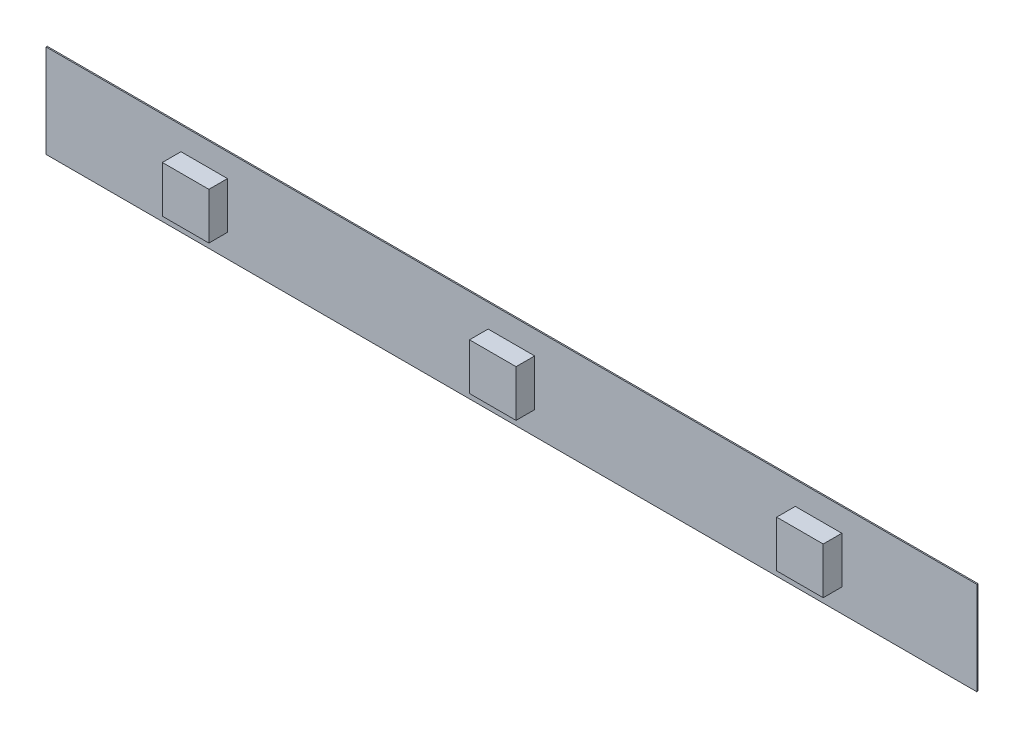
ISO-10303-21;
HEADER;
FILE_DESCRIPTION(('STEP AP214'),'2;1');
FILE_NAME('part.step','',(''),(''),'','','');
FILE_SCHEMA(('AUTOMOTIVE_DESIGN { 1 0 10303 214 1 1 1 1 }'));
ENDSEC;
DATA;
#1=APPLICATION_CONTEXT('core data for automotive mechanical design processes');
#2=APPLICATION_PROTOCOL_DEFINITION('international standard','automotive_design',2000,#1);
#3=PRODUCT_CONTEXT('',#1,'mechanical');
#4=PRODUCT('Part','Part','',(#3));
#5=PRODUCT_RELATED_PRODUCT_CATEGORY('part','',(#4));
#6=PRODUCT_DEFINITION_FORMATION('','',#4);
#7=PRODUCT_DEFINITION_CONTEXT('part definition',#1,'design');
#8=PRODUCT_DEFINITION('design','',#6,#7);
#9=PRODUCT_DEFINITION_SHAPE('','',#8);
#10=(LENGTH_UNIT() NAMED_UNIT(*) SI_UNIT(.MILLI.,.METRE.));
#11=(NAMED_UNIT(*) PLANE_ANGLE_UNIT() SI_UNIT($,.RADIAN.));
#12=(NAMED_UNIT(*) SI_UNIT($,.STERADIAN.) SOLID_ANGLE_UNIT());
#13=UNCERTAINTY_MEASURE_WITH_UNIT(LENGTH_MEASURE(1.E-05),#10,'distance_accuracy_value','');
#14=(GEOMETRIC_REPRESENTATION_CONTEXT(3) GLOBAL_UNCERTAINTY_ASSIGNED_CONTEXT((#13)) GLOBAL_UNIT_ASSIGNED_CONTEXT((#10,
#11,#12)) REPRESENTATION_CONTEXT('',''));
#15=CARTESIAN_POINT('',(0.,0.,0.));
#16=DIRECTION('',(0.,0.,1.));
#17=DIRECTION('',(1.,0.,0.));
#18=AXIS2_PLACEMENT_3D('',#15,#16,#17);
#19=CARTESIAN_POINT('',(0.,0.,0.13));
#20=DIRECTION('',(0.,0.,1.));
#21=DIRECTION('',(1.,0.,0.));
#22=AXIS2_PLACEMENT_3D('',#19,#20,#21);
#23=PLANE('',#22);
#24=DIRECTION('',(0.,-1.,0.));
#25=VECTOR('',#24,1.);
#26=CARTESIAN_POINT('',(-54.4155040130895,5.80985915492958,0.13));
#27=LINE('',#26,#25);
#28=CARTESIAN_POINT('',(-54.4155040130895,5.80985915492958,0.13));
#29=VERTEX_POINT('',#28);
#30=CARTESIAN_POINT('',(-54.4155040130895,-4.19014084507042,0.13));
#31=VERTEX_POINT('',#30);
#32=EDGE_CURVE('E234',#29,#31,#27,.T.);
#33=ORIENTED_EDGE('',*,*,#32,.T.);
#34=DIRECTION('',(1.,0.,0.));
#35=VECTOR('',#34,1.);
#36=CARTESIAN_POINT('',(-54.4155040130895,-4.19014084507042,0.13));
#37=LINE('',#36,#35);
#38=CARTESIAN_POINT('',(45.5844959869105,-4.19014084507042,0.13));
#39=VERTEX_POINT('',#38);
#40=EDGE_CURVE('E237',#31,#39,#37,.T.);
#41=ORIENTED_EDGE('',*,*,#40,.T.);
#42=DIRECTION('',(0.,1.,0.));
#43=VECTOR('',#42,1.);
#44=CARTESIAN_POINT('',(45.5844959869105,5.80985915492958,0.13));
#45=LINE('',#44,#43);
#46=CARTESIAN_POINT('',(45.5844959869105,5.80985915492958,0.13));
#47=VERTEX_POINT('',#46);
#48=EDGE_CURVE('E240',#39,#47,#45,.T.);
#49=ORIENTED_EDGE('',*,*,#48,.T.);
#50=DIRECTION('',(-1.,0.,0.));
#51=VECTOR('',#50,1.);
#52=CARTESIAN_POINT('',(-54.4155040130895,5.80985915492958,0.13));
#53=LINE('',#52,#51);
#54=EDGE_CURVE('E242',#47,#29,#53,.T.);
#55=ORIENTED_EDGE('',*,*,#54,.T.);
#56=EDGE_LOOP('',(#33,#41,#49,#55));
#57=FACE_BOUND('',#56,.T.);
#58=DIRECTION('',(1.,0.,0.));
#59=VECTOR('',#58,1.);
#60=CARTESIAN_POINT('',(-39.9155040130895,-1.69014084507042,0.13));
#61=LINE('',#60,#59);
#62=CARTESIAN_POINT('',(-39.9155040130895,-1.69014084507042,0.13));
#63=VERTEX_POINT('',#62);
#64=CARTESIAN_POINT('',(-34.9155040130895,-1.69014084507042,0.13));
#65=VERTEX_POINT('',#64);
#66=EDGE_CURVE('E218',#63,#65,#61,.T.);
#67=ORIENTED_EDGE('',*,*,#66,.F.);
#68=DIRECTION('',(0.,-1.,0.));
#69=VECTOR('',#68,1.);
#70=CARTESIAN_POINT('',(-39.9155040130895,3.30985915492958,0.13));
#71=LINE('',#70,#69);
#72=CARTESIAN_POINT('',(-39.9155040130895,3.30985915492958,0.13));
#73=VERTEX_POINT('',#72);
#74=EDGE_CURVE('E204',#73,#63,#71,.T.);
#75=ORIENTED_EDGE('',*,*,#74,.F.);
#76=DIRECTION('',(-1.,0.,0.));
#77=VECTOR('',#76,1.);
#78=CARTESIAN_POINT('',(-39.9155040130895,3.30985915492958,0.13));
#79=LINE('',#78,#77);
#80=CARTESIAN_POINT('',(-34.9155040130895,3.30985915492958,0.13));
#81=VERTEX_POINT('',#80);
#82=EDGE_CURVE('E209',#81,#73,#79,.T.);
#83=ORIENTED_EDGE('',*,*,#82,.F.);
#84=DIRECTION('',(0.,1.,0.));
#85=VECTOR('',#84,1.);
#86=CARTESIAN_POINT('',(-34.9155040130895,3.30985915492958,0.13));
#87=LINE('',#86,#85);
#88=EDGE_CURVE('E220',#65,#81,#87,.T.);
#89=ORIENTED_EDGE('',*,*,#88,.F.);
#90=EDGE_LOOP('',(#67,#75,#83,#89));
#91=FACE_BOUND('',#90,.T.);
#92=DIRECTION('',(1.,0.,0.));
#93=VECTOR('',#92,1.);
#94=CARTESIAN_POINT('',(-6.91550401308951,-1.69014084507042,0.13));
#95=LINE('',#94,#93);
#96=CARTESIAN_POINT('',(-6.91550401308951,-1.69014084507042,0.13));
#97=VERTEX_POINT('',#96);
#98=CARTESIAN_POINT('',(-1.91550401308951,-1.69014084507042,0.13));
#99=VERTEX_POINT('',#98);
#100=EDGE_CURVE('E176',#97,#99,#95,.T.);
#101=ORIENTED_EDGE('',*,*,#100,.F.);
#102=DIRECTION('',(0.,-1.,0.));
#103=VECTOR('',#102,1.);
#104=CARTESIAN_POINT('',(-6.91550401308951,3.30985915492958,0.13));
#105=LINE('',#104,#103);
#106=CARTESIAN_POINT('',(-6.91550401308951,3.30985915492958,0.13));
#107=VERTEX_POINT('',#106);
#108=EDGE_CURVE('E173',#107,#97,#105,.T.);
#109=ORIENTED_EDGE('',*,*,#108,.F.);
#110=DIRECTION('',(-1.,0.,0.));
#111=VECTOR('',#110,1.);
#112=CARTESIAN_POINT('',(-6.91550401308951,3.30985915492958,0.13));
#113=LINE('',#112,#111);
#114=CARTESIAN_POINT('',(-1.91550401308951,3.30985915492958,0.13));
#115=VERTEX_POINT('',#114);
#116=EDGE_CURVE('E185',#115,#107,#113,.T.);
#117=ORIENTED_EDGE('',*,*,#116,.F.);
#118=DIRECTION('',(0.,1.,0.));
#119=VECTOR('',#118,1.);
#120=CARTESIAN_POINT('',(-1.91550401308951,3.30985915492958,0.13));
#121=LINE('',#120,#119);
#122=EDGE_CURVE('E193',#99,#115,#121,.T.);
#123=ORIENTED_EDGE('',*,*,#122,.F.);
#124=EDGE_LOOP('',(#101,#109,#117,#123));
#125=FACE_BOUND('',#124,.T.);
#126=DIRECTION('',(1.,0.,0.));
#127=VECTOR('',#126,1.);
#128=CARTESIAN_POINT('',(26.0844959869105,-1.69014084507042,0.13));
#129=LINE('',#128,#127);
#130=CARTESIAN_POINT('',(26.0844959869105,-1.69014084507042,0.13));
#131=VERTEX_POINT('',#130);
#132=CARTESIAN_POINT('',(31.0844959869105,-1.69014084507042,0.13));
#133=VERTEX_POINT('',#132);
#134=EDGE_CURVE('E507',#131,#133,#129,.T.);
#135=ORIENTED_EDGE('',*,*,#134,.F.);
#136=DIRECTION('',(0.,-1.,0.));
#137=VECTOR('',#136,1.);
#138=CARTESIAN_POINT('',(26.0844959869105,3.30985915492958,0.13));
#139=LINE('',#138,#137);
#140=CARTESIAN_POINT('',(26.0844959869105,3.30985915492958,0.13));
#141=VERTEX_POINT('',#140);
#142=EDGE_CURVE('E171',#141,#131,#139,.T.);
#143=ORIENTED_EDGE('',*,*,#142,.F.);
#144=DIRECTION('',(-1.,0.,0.));
#145=VECTOR('',#144,1.);
#146=CARTESIAN_POINT('',(26.0844959869105,3.30985915492958,0.13));
#147=LINE('',#146,#145);
#148=CARTESIAN_POINT('',(31.0844959869103,3.30985915492958,0.13));
#149=VERTEX_POINT('',#148);
#150=EDGE_CURVE('E167',#149,#141,#147,.T.);
#151=ORIENTED_EDGE('',*,*,#150,.F.);
#152=DIRECTION('',(0.,1.,0.));
#153=VECTOR('',#152,1.);
#154=CARTESIAN_POINT('',(31.0844959869103,3.30985915492958,0.13));
#155=LINE('',#154,#153);
#156=EDGE_CURVE('E504',#133,#149,#155,.T.);
#157=ORIENTED_EDGE('',*,*,#156,.F.);
#158=EDGE_LOOP('',(#135,#143,#151,#157));
#159=FACE_BOUND('',#158,.T.);
#160=ADVANCED_FACE('F34',(#57,#91,#125,#159),#23,.T.);
#161=CARTESIAN_POINT('',(-54.4155040130895,5.80985915492958,0.13));
#162=DIRECTION('',(1.,0.,0.));
#163=DIRECTION('',(0.,1.,0.));
#164=AXIS2_PLACEMENT_3D('',#161,#162,#163);
#165=PLANE('',#164);
#166=DIRECTION('',(0.,-1.,0.));
#167=VECTOR('',#166,1.);
#168=CARTESIAN_POINT('',(-54.4155040130895,5.80985915492958,0.));
#169=LINE('',#168,#167);
#170=CARTESIAN_POINT('',(-54.4155040130895,5.80985915492958,0.));
#171=VERTEX_POINT('',#170);
#172=CARTESIAN_POINT('',(-54.4155040130895,-4.19014084507042,0.));
#173=VERTEX_POINT('',#172);
#174=EDGE_CURVE('E233',#171,#173,#169,.T.);
#175=ORIENTED_EDGE('',*,*,#174,.T.);
#176=DIRECTION('',(0.,0.,-1.));
#177=VECTOR('',#176,1.);
#178=CARTESIAN_POINT('',(-54.4155040130895,-4.19014084507042,0.13));
#179=LINE('',#178,#177);
#180=EDGE_CURVE('E11',#31,#173,#179,.T.);
#181=ORIENTED_EDGE('',*,*,#180,.F.);
#182=ORIENTED_EDGE('',*,*,#32,.F.);
#183=DIRECTION('',(0.,0.,-1.));
#184=VECTOR('',#183,1.);
#185=CARTESIAN_POINT('',(-54.4155040130895,5.80985915492958,0.13));
#186=LINE('',#185,#184);
#187=EDGE_CURVE('E244',#29,#171,#186,.T.);
#188=ORIENTED_EDGE('',*,*,#187,.T.);
#189=EDGE_LOOP('',(#175,#181,#182,#188));
#190=FACE_BOUND('',#189,.T.);
#191=ADVANCED_FACE('F36',(#190),#165,.F.);
#192=CARTESIAN_POINT('',(-54.4155040130895,-4.19014084507042,0.13));
#193=DIRECTION('',(0.,1.,0.));
#194=DIRECTION('',(0.,0.,1.));
#195=AXIS2_PLACEMENT_3D('',#192,#193,#194);
#196=PLANE('',#195);
#197=DIRECTION('',(1.,0.,0.));
#198=VECTOR('',#197,1.);
#199=CARTESIAN_POINT('',(-54.4155040130895,-4.19014084507042,0.));
#200=LINE('',#199,#198);
#201=CARTESIAN_POINT('',(45.5844959869105,-4.19014084507042,0.));
#202=VERTEX_POINT('',#201);
#203=EDGE_CURVE('E247',#173,#202,#200,.T.);
#204=ORIENTED_EDGE('',*,*,#203,.T.);
#205=DIRECTION('',(0.,0.,-1.));
#206=VECTOR('',#205,1.);
#207=CARTESIAN_POINT('',(45.5844959869105,-4.19014084507042,0.13));
#208=LINE('',#207,#206);
#209=EDGE_CURVE('E42',#39,#202,#208,.T.);
#210=ORIENTED_EDGE('',*,*,#209,.F.);
#211=ORIENTED_EDGE('',*,*,#40,.F.);
#212=ORIENTED_EDGE('',*,*,#180,.T.);
#213=EDGE_LOOP('',(#204,#210,#211,#212));
#214=FACE_BOUND('',#213,.T.);
#215=ADVANCED_FACE('F277',(#214),#196,.F.);
#216=CARTESIAN_POINT('',(45.5844959869105,5.80985915492958,0.13));
#217=DIRECTION('',(-1.,0.,0.));
#218=DIRECTION('',(0.,0.,1.));
#219=AXIS2_PLACEMENT_3D('',#216,#217,#218);
#220=PLANE('',#219);
#221=DIRECTION('',(0.,1.,0.));
#222=VECTOR('',#221,1.);
#223=CARTESIAN_POINT('',(45.5844959869105,5.80985915492958,0.));
#224=LINE('',#223,#222);
#225=CARTESIAN_POINT('',(45.5844959869105,5.80985915492958,0.));
#226=VERTEX_POINT('',#225);
#227=EDGE_CURVE('E249',#202,#226,#224,.T.);
#228=ORIENTED_EDGE('',*,*,#227,.T.);
#229=DIRECTION('',(0.,0.,-1.));
#230=VECTOR('',#229,1.);
#231=CARTESIAN_POINT('',(45.5844959869105,5.80985915492958,0.13));
#232=LINE('',#231,#230);
#233=EDGE_CURVE('E254',#47,#226,#232,.T.);
#234=ORIENTED_EDGE('',*,*,#233,.F.);
#235=ORIENTED_EDGE('',*,*,#48,.F.);
#236=ORIENTED_EDGE('',*,*,#209,.T.);
#237=EDGE_LOOP('',(#228,#234,#235,#236));
#238=FACE_BOUND('',#237,.T.);
#239=ADVANCED_FACE('F261',(#238),#220,.F.);
#240=CARTESIAN_POINT('',(-54.4155040130895,5.80985915492958,0.13));
#241=DIRECTION('',(0.,-1.,0.));
#242=DIRECTION('',(0.,0.,-1.));
#243=AXIS2_PLACEMENT_3D('',#240,#241,#242);
#244=PLANE('',#243);
#245=DIRECTION('',(-1.,0.,0.));
#246=VECTOR('',#245,1.);
#247=CARTESIAN_POINT('',(-54.4155040130895,5.80985915492958,0.));
#248=LINE('',#247,#246);
#249=EDGE_CURVE('E238',#226,#171,#248,.T.);
#250=ORIENTED_EDGE('',*,*,#249,.T.);
#251=ORIENTED_EDGE('',*,*,#187,.F.);
#252=ORIENTED_EDGE('',*,*,#54,.F.);
#253=ORIENTED_EDGE('',*,*,#233,.T.);
#254=EDGE_LOOP('',(#250,#251,#252,#253));
#255=FACE_BOUND('',#254,.T.);
#256=ADVANCED_FACE('F270',(#255),#244,.F.);
#257=CARTESIAN_POINT('',(0.,0.,0.));
#258=DIRECTION('',(0.,0.,1.));
#259=DIRECTION('',(1.,0.,0.));
#260=AXIS2_PLACEMENT_3D('',#257,#258,#259);
#261=PLANE('',#260);
#262=ORIENTED_EDGE('',*,*,#174,.F.);
#263=ORIENTED_EDGE('',*,*,#249,.F.);
#264=ORIENTED_EDGE('',*,*,#227,.F.);
#265=ORIENTED_EDGE('',*,*,#203,.F.);
#266=EDGE_LOOP('',(#262,#263,#264,#265));
#267=FACE_BOUND('',#266,.T.);
#268=ADVANCED_FACE('F267',(#267),#261,.F.);
#269=CARTESIAN_POINT('',(-39.9155040130895,3.30985915492958,2.13));
#270=DIRECTION('',(1.,0.,0.));
#271=DIRECTION('',(0.,0.,-1.));
#272=AXIS2_PLACEMENT_3D('',#269,#270,#271);
#273=PLANE('',#272);
#274=ORIENTED_EDGE('',*,*,#74,.T.);
#275=DIRECTION('',(0.,0.,-1.));
#276=VECTOR('',#275,1.);
#277=CARTESIAN_POINT('',(-39.9155040130895,-1.69014084507042,2.13));
#278=LINE('',#277,#276);
#279=CARTESIAN_POINT('',(-39.9155040130895,-1.69014084507042,2.13));
#280=VERTEX_POINT('',#279);
#281=EDGE_CURVE('E231',#280,#63,#278,.T.);
#282=ORIENTED_EDGE('',*,*,#281,.F.);
#283=DIRECTION('',(0.,-1.,0.));
#284=VECTOR('',#283,1.);
#285=CARTESIAN_POINT('',(-39.9155040130895,3.30985915492958,2.13));
#286=LINE('',#285,#284);
#287=CARTESIAN_POINT('',(-39.9155040130895,3.30985915492958,2.13));
#288=VERTEX_POINT('',#287);
#289=EDGE_CURVE('E205',#288,#280,#286,.T.);
#290=ORIENTED_EDGE('',*,*,#289,.F.);
#291=DIRECTION('',(0.,0.,-1.));
#292=VECTOR('',#291,1.);
#293=CARTESIAN_POINT('',(-39.9155040130895,3.30985915492958,2.13));
#294=LINE('',#293,#292);
#295=EDGE_CURVE('E215',#288,#73,#294,.T.);
#296=ORIENTED_EDGE('',*,*,#295,.T.);
#297=EDGE_LOOP('',(#274,#282,#290,#296));
#298=FACE_BOUND('',#297,.T.);
#299=ADVANCED_FACE('F290',(#298),#273,.F.);
#300=CARTESIAN_POINT('',(-39.9155040130895,-1.69014084507042,2.13));
#301=DIRECTION('',(0.,1.,0.));
#302=DIRECTION('',(-1.,0.,0.));
#303=AXIS2_PLACEMENT_3D('',#300,#301,#302);
#304=PLANE('',#303);
#305=ORIENTED_EDGE('',*,*,#66,.T.);
#306=DIRECTION('',(0.,0.,-1.));
#307=VECTOR('',#306,1.);
#308=CARTESIAN_POINT('',(-34.9155040130895,-1.69014084507042,2.13));
#309=LINE('',#308,#307);
#310=CARTESIAN_POINT('',(-34.9155040130895,-1.69014084507042,2.13));
#311=VERTEX_POINT('',#310);
#312=EDGE_CURVE('E228',#311,#65,#309,.T.);
#313=ORIENTED_EDGE('',*,*,#312,.F.);
#314=DIRECTION('',(1.,0.,0.));
#315=VECTOR('',#314,1.);
#316=CARTESIAN_POINT('',(-39.9155040130895,-1.69014084507042,2.13));
#317=LINE('',#316,#315);
#318=EDGE_CURVE('E208',#280,#311,#317,.T.);
#319=ORIENTED_EDGE('',*,*,#318,.F.);
#320=ORIENTED_EDGE('',*,*,#281,.T.);
#321=EDGE_LOOP('',(#305,#313,#319,#320));
#322=FACE_BOUND('',#321,.T.);
#323=ADVANCED_FACE('F310',(#322),#304,.F.);
#324=CARTESIAN_POINT('',(-34.9155040130895,3.30985915492958,2.13));
#325=DIRECTION('',(-1.,0.,0.));
#326=DIRECTION('',(0.,0.,1.));
#327=AXIS2_PLACEMENT_3D('',#324,#325,#326);
#328=PLANE('',#327);
#329=ORIENTED_EDGE('',*,*,#88,.T.);
#330=DIRECTION('',(0.,0.,-1.));
#331=VECTOR('',#330,1.);
#332=CARTESIAN_POINT('',(-34.9155040130895,3.30985915492958,2.13));
#333=LINE('',#332,#331);
#334=CARTESIAN_POINT('',(-34.9155040130895,3.30985915492958,2.13));
#335=VERTEX_POINT('',#334);
#336=EDGE_CURVE('E226',#335,#81,#333,.T.);
#337=ORIENTED_EDGE('',*,*,#336,.F.);
#338=DIRECTION('',(0.,1.,0.));
#339=VECTOR('',#338,1.);
#340=CARTESIAN_POINT('',(-34.9155040130895,3.30985915492958,2.13));
#341=LINE('',#340,#339);
#342=EDGE_CURVE('E211',#311,#335,#341,.T.);
#343=ORIENTED_EDGE('',*,*,#342,.F.);
#344=ORIENTED_EDGE('',*,*,#312,.T.);
#345=EDGE_LOOP('',(#329,#337,#343,#344));
#346=FACE_BOUND('',#345,.T.);
#347=ADVANCED_FACE('F319',(#346),#328,.F.);
#348=CARTESIAN_POINT('',(-39.9155040130895,3.30985915492958,2.13));
#349=DIRECTION('',(0.,-1.,0.));
#350=DIRECTION('',(0.,0.,-1.));
#351=AXIS2_PLACEMENT_3D('',#348,#349,#350);
#352=PLANE('',#351);
#353=ORIENTED_EDGE('',*,*,#82,.T.);
#354=ORIENTED_EDGE('',*,*,#295,.F.);
#355=DIRECTION('',(-1.,0.,0.));
#356=VECTOR('',#355,1.);
#357=CARTESIAN_POINT('',(-39.9155040130895,3.30985915492958,2.13));
#358=LINE('',#357,#356);
#359=EDGE_CURVE('E213',#335,#288,#358,.T.);
#360=ORIENTED_EDGE('',*,*,#359,.F.);
#361=ORIENTED_EDGE('',*,*,#336,.T.);
#362=EDGE_LOOP('',(#353,#354,#360,#361));
#363=FACE_BOUND('',#362,.T.);
#364=ADVANCED_FACE('F327',(#363),#352,.F.);
#365=CARTESIAN_POINT('',(0.,0.,2.13));
#366=DIRECTION('',(0.,0.,1.));
#367=DIRECTION('',(1.,0.,0.));
#368=AXIS2_PLACEMENT_3D('',#365,#366,#367);
#369=PLANE('',#368);
#370=ORIENTED_EDGE('',*,*,#289,.T.);
#371=ORIENTED_EDGE('',*,*,#318,.T.);
#372=ORIENTED_EDGE('',*,*,#342,.T.);
#373=ORIENTED_EDGE('',*,*,#359,.T.);
#374=EDGE_LOOP('',(#370,#371,#372,#373));
#375=FACE_BOUND('',#374,.T.);
#376=ADVANCED_FACE('F335',(#375),#369,.T.);
#377=CARTESIAN_POINT('',(-6.91550401308951,3.30985915492958,2.13));
#378=DIRECTION('',(1.,0.,0.));
#379=DIRECTION('',(0.,1.,0.));
#380=AXIS2_PLACEMENT_3D('',#377,#378,#379);
#381=PLANE('',#380);
#382=ORIENTED_EDGE('',*,*,#108,.T.);
#383=DIRECTION('',(0.,0.,-1.));
#384=VECTOR('',#383,1.);
#385=CARTESIAN_POINT('',(-6.91550401308951,-1.69014084507042,2.13));
#386=LINE('',#385,#384);
#387=CARTESIAN_POINT('',(-6.91550401308951,-1.69014084507042,2.13));
#388=VERTEX_POINT('',#387);
#389=EDGE_CURVE('E202',#388,#97,#386,.T.);
#390=ORIENTED_EDGE('',*,*,#389,.F.);
#391=DIRECTION('',(0.,-1.,0.));
#392=VECTOR('',#391,1.);
#393=CARTESIAN_POINT('',(-6.91550401308951,3.30985915492958,2.13));
#394=LINE('',#393,#392);
#395=CARTESIAN_POINT('',(-6.91550401308951,3.30985915492958,2.13));
#396=VERTEX_POINT('',#395);
#397=EDGE_CURVE('E181',#396,#388,#394,.T.);
#398=ORIENTED_EDGE('',*,*,#397,.F.);
#399=DIRECTION('',(0.,0.,-1.));
#400=VECTOR('',#399,1.);
#401=CARTESIAN_POINT('',(-6.91550401308951,3.30985915492958,2.13));
#402=LINE('',#401,#400);
#403=EDGE_CURVE('E190',#396,#107,#402,.T.);
#404=ORIENTED_EDGE('',*,*,#403,.T.);
#405=EDGE_LOOP('',(#382,#390,#398,#404));
#406=FACE_BOUND('',#405,.T.);
#407=ADVANCED_FACE('F342',(#406),#381,.F.);
#408=CARTESIAN_POINT('',(-6.91550401308951,-1.69014084507042,2.13));
#409=DIRECTION('',(0.,1.,0.));
#410=DIRECTION('',(0.,0.,1.));
#411=AXIS2_PLACEMENT_3D('',#408,#409,#410);
#412=PLANE('',#411);
#413=ORIENTED_EDGE('',*,*,#100,.T.);
#414=DIRECTION('',(0.,0.,-1.));
#415=VECTOR('',#414,1.);
#416=CARTESIAN_POINT('',(-1.91550401308951,-1.69014084507042,2.13));
#417=LINE('',#416,#415);
#418=CARTESIAN_POINT('',(-1.91550401308951,-1.69014084507042,2.13));
#419=VERTEX_POINT('',#418);
#420=EDGE_CURVE('E199',#419,#99,#417,.T.);
#421=ORIENTED_EDGE('',*,*,#420,.F.);
#422=DIRECTION('',(1.,0.,0.));
#423=VECTOR('',#422,1.);
#424=CARTESIAN_POINT('',(-6.91550401308951,-1.69014084507042,2.13));
#425=LINE('',#424,#423);
#426=EDGE_CURVE('E184',#388,#419,#425,.T.);
#427=ORIENTED_EDGE('',*,*,#426,.F.);
#428=ORIENTED_EDGE('',*,*,#389,.T.);
#429=EDGE_LOOP('',(#413,#421,#427,#428));
#430=FACE_BOUND('',#429,.T.);
#431=ADVANCED_FACE('F350',(#430),#412,.F.);
#432=CARTESIAN_POINT('',(-1.91550401308951,3.30985915492958,2.13));
#433=DIRECTION('',(-1.,0.,0.));
#434=DIRECTION('',(0.,0.,1.));
#435=AXIS2_PLACEMENT_3D('',#432,#433,#434);
#436=PLANE('',#435);
#437=ORIENTED_EDGE('',*,*,#122,.T.);
#438=DIRECTION('',(0.,0.,-1.));
#439=VECTOR('',#438,1.);
#440=CARTESIAN_POINT('',(-1.91550401308951,3.30985915492958,2.13));
#441=LINE('',#440,#439);
#442=CARTESIAN_POINT('',(-1.91550401308951,3.30985915492958,2.13));
#443=VERTEX_POINT('',#442);
#444=EDGE_CURVE('E57',#443,#115,#441,.T.);
#445=ORIENTED_EDGE('',*,*,#444,.F.);
#446=DIRECTION('',(0.,1.,0.));
#447=VECTOR('',#446,1.);
#448=CARTESIAN_POINT('',(-1.91550401308951,3.30985915492958,2.13));
#449=LINE('',#448,#447);
#450=EDGE_CURVE('E187',#419,#443,#449,.T.);
#451=ORIENTED_EDGE('',*,*,#450,.F.);
#452=ORIENTED_EDGE('',*,*,#420,.T.);
#453=EDGE_LOOP('',(#437,#445,#451,#452));
#454=FACE_BOUND('',#453,.T.);
#455=ADVANCED_FACE('F358',(#454),#436,.F.);
#456=CARTESIAN_POINT('',(-6.91550401308951,3.30985915492958,2.13));
#457=DIRECTION('',(0.,-1.,0.));
#458=DIRECTION('',(1.,0.,0.));
#459=AXIS2_PLACEMENT_3D('',#456,#457,#458);
#460=PLANE('',#459);
#461=ORIENTED_EDGE('',*,*,#116,.T.);
#462=ORIENTED_EDGE('',*,*,#403,.F.);
#463=DIRECTION('',(-1.,0.,0.));
#464=VECTOR('',#463,1.);
#465=CARTESIAN_POINT('',(-6.91550401308951,3.30985915492958,2.13));
#466=LINE('',#465,#464);
#467=EDGE_CURVE('E189',#443,#396,#466,.T.);
#468=ORIENTED_EDGE('',*,*,#467,.F.);
#469=ORIENTED_EDGE('',*,*,#444,.T.);
#470=EDGE_LOOP('',(#461,#462,#468,#469));
#471=FACE_BOUND('',#470,.T.);
#472=ADVANCED_FACE('F366',(#471),#460,.F.);
#473=CARTESIAN_POINT('',(0.,0.,2.13));
#474=DIRECTION('',(0.,0.,1.));
#475=DIRECTION('',(1.,0.,0.));
#476=AXIS2_PLACEMENT_3D('',#473,#474,#475);
#477=PLANE('',#476);
#478=ORIENTED_EDGE('',*,*,#397,.T.);
#479=ORIENTED_EDGE('',*,*,#426,.T.);
#480=ORIENTED_EDGE('',*,*,#450,.T.);
#481=ORIENTED_EDGE('',*,*,#467,.T.);
#482=EDGE_LOOP('',(#478,#479,#480,#481));
#483=FACE_BOUND('',#482,.T.);
#484=ADVANCED_FACE('F374',(#483),#477,.T.);
#485=CARTESIAN_POINT('',(26.0844959869105,3.30985915492958,2.13));
#486=DIRECTION('',(1.,0.,0.));
#487=DIRECTION('',(0.,0.,-1.));
#488=AXIS2_PLACEMENT_3D('',#485,#486,#487);
#489=PLANE('',#488);
#490=ORIENTED_EDGE('',*,*,#142,.T.);
#491=DIRECTION('',(0.,0.,-1.));
#492=VECTOR('',#491,1.);
#493=CARTESIAN_POINT('',(26.0844959869105,-1.69014084507042,2.13));
#494=LINE('',#493,#492);
#495=CARTESIAN_POINT('',(26.0844959869105,-1.69014084507042,2.13));
#496=VERTEX_POINT('',#495);
#497=EDGE_CURVE('E152',#496,#131,#494,.T.);
#498=ORIENTED_EDGE('',*,*,#497,.F.);
#499=DIRECTION('',(0.,-1.,0.));
#500=VECTOR('',#499,1.);
#501=CARTESIAN_POINT('',(26.0844959869105,3.30985915492958,2.13));
#502=LINE('',#501,#500);
#503=CARTESIAN_POINT('',(26.0844959869105,3.30985915492958,2.13));
#504=VERTEX_POINT('',#503);
#505=EDGE_CURVE('E159',#504,#496,#502,.T.);
#506=ORIENTED_EDGE('',*,*,#505,.F.);
#507=DIRECTION('',(0.,0.,-1.));
#508=VECTOR('',#507,1.);
#509=CARTESIAN_POINT('',(26.0844959869105,3.30985915492958,2.13));
#510=LINE('',#509,#508);
#511=EDGE_CURVE('E501',#504,#141,#510,.T.);
#512=ORIENTED_EDGE('',*,*,#511,.T.);
#513=EDGE_LOOP('',(#490,#498,#506,#512));
#514=FACE_BOUND('',#513,.T.);
#515=ADVANCED_FACE('F169',(#514),#489,.F.);
#516=CARTESIAN_POINT('',(26.0844959869105,-1.69014084507042,2.13));
#517=DIRECTION('',(0.,1.,0.));
#518=DIRECTION('',(0.,0.,1.));
#519=AXIS2_PLACEMENT_3D('',#516,#517,#518);
#520=PLANE('',#519);
#521=ORIENTED_EDGE('',*,*,#134,.T.);
#522=DIRECTION('',(0.,0.,-1.));
#523=VECTOR('',#522,1.);
#524=CARTESIAN_POINT('',(31.0844959869105,-1.69014084507042,2.13));
#525=LINE('',#524,#523);
#526=CARTESIAN_POINT('',(31.0844959869105,-1.69014084507042,2.13));
#527=VERTEX_POINT('',#526);
#528=EDGE_CURVE('E155',#527,#133,#525,.T.);
#529=ORIENTED_EDGE('',*,*,#528,.F.);
#530=DIRECTION('',(1.,0.,0.));
#531=VECTOR('',#530,1.);
#532=CARTESIAN_POINT('',(26.0844959869105,-1.69014084507042,2.13));
#533=LINE('',#532,#531);
#534=EDGE_CURVE('E148',#496,#527,#533,.T.);
#535=ORIENTED_EDGE('',*,*,#534,.F.);
#536=ORIENTED_EDGE('',*,*,#497,.T.);
#537=EDGE_LOOP('',(#521,#529,#535,#536));
#538=FACE_BOUND('',#537,.T.);
#539=ADVANCED_FACE('F150',(#538),#520,.F.);
#540=CARTESIAN_POINT('',(31.0844959869103,3.30985915492958,2.13));
#541=DIRECTION('',(-1.,0.,0.));
#542=DIRECTION('',(0.,-1.,0.));
#543=AXIS2_PLACEMENT_3D('',#540,#541,#542);
#544=PLANE('',#543);
#545=ORIENTED_EDGE('',*,*,#156,.T.);
#546=DIRECTION('',(0.,0.,-1.));
#547=VECTOR('',#546,1.);
#548=CARTESIAN_POINT('',(31.0844959869103,3.30985915492958,2.13));
#549=LINE('',#548,#547);
#550=CARTESIAN_POINT('',(31.0844959869103,3.30985915492958,2.13));
#551=VERTEX_POINT('',#550);
#552=EDGE_CURVE('E49',#551,#149,#549,.T.);
#553=ORIENTED_EDGE('',*,*,#552,.F.);
#554=DIRECTION('',(0.,1.,0.));
#555=VECTOR('',#554,1.);
#556=CARTESIAN_POINT('',(31.0844959869103,3.30985915492958,2.13));
#557=LINE('',#556,#555);
#558=EDGE_CURVE('E158',#527,#551,#557,.T.);
#559=ORIENTED_EDGE('',*,*,#558,.F.);
#560=ORIENTED_EDGE('',*,*,#528,.T.);
#561=EDGE_LOOP('',(#545,#553,#559,#560));
#562=FACE_BOUND('',#561,.T.);
#563=ADVANCED_FACE('F394',(#562),#544,.F.);
#564=CARTESIAN_POINT('',(26.0844959869105,3.30985915492958,2.13));
#565=DIRECTION('',(0.,-1.,0.));
#566=DIRECTION('',(1.,0.,0.));
#567=AXIS2_PLACEMENT_3D('',#564,#565,#566);
#568=PLANE('',#567);
#569=ORIENTED_EDGE('',*,*,#150,.T.);
#570=ORIENTED_EDGE('',*,*,#511,.F.);
#571=DIRECTION('',(-1.,0.,0.));
#572=VECTOR('',#571,1.);
#573=CARTESIAN_POINT('',(26.0844959869105,3.30985915492958,2.13));
#574=LINE('',#573,#572);
#575=EDGE_CURVE('E163',#551,#504,#574,.T.);
#576=ORIENTED_EDGE('',*,*,#575,.F.);
#577=ORIENTED_EDGE('',*,*,#552,.T.);
#578=EDGE_LOOP('',(#569,#570,#576,#577));
#579=FACE_BOUND('',#578,.T.);
#580=ADVANCED_FACE('F400',(#579),#568,.F.);
#581=CARTESIAN_POINT('',(0.,0.,2.13));
#582=DIRECTION('',(0.,0.,1.));
#583=DIRECTION('',(1.,0.,0.));
#584=AXIS2_PLACEMENT_3D('',#581,#582,#583);
#585=PLANE('',#584);
#586=ORIENTED_EDGE('',*,*,#505,.T.);
#587=ORIENTED_EDGE('',*,*,#534,.T.);
#588=ORIENTED_EDGE('',*,*,#558,.T.);
#589=ORIENTED_EDGE('',*,*,#575,.T.);
#590=EDGE_LOOP('',(#586,#587,#588,#589));
#591=FACE_BOUND('',#590,.T.);
#592=ADVANCED_FACE('F162',(#591),#585,.T.);
#593=CLOSED_SHELL('',(#160,#191,#215,#239,#256,#268,#299,#323,#347,#364,#376,#407,#431,#455,
#472,#484,#515,#539,#563,#580,#592));
#594=MANIFOLD_SOLID_BREP('B2',#593);
#595=ADVANCED_BREP_SHAPE_REPRESENTATION('',(#18,#594),#14);
#596=SHAPE_DEFINITION_REPRESENTATION(#9,#595);
ENDSEC;
END-ISO-10303-21;
